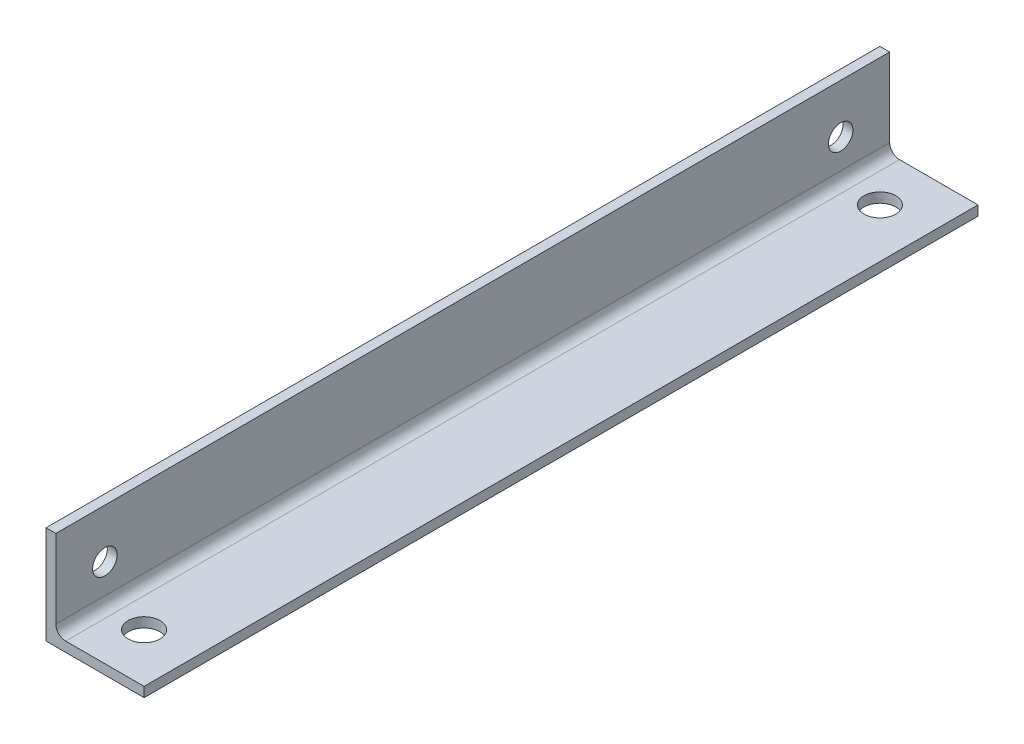
ISO-10303-21;
HEADER;
FILE_DESCRIPTION(('STEP AP214'),'2;1');
FILE_NAME('part.step','',(''),(''),'','','');
FILE_SCHEMA(('AUTOMOTIVE_DESIGN { 1 0 10303 214 1 1 1 1 }'));
ENDSEC;
DATA;
#1=APPLICATION_CONTEXT('core data for automotive mechanical design processes');
#2=APPLICATION_PROTOCOL_DEFINITION('international standard','automotive_design',2000,#1);
#3=PRODUCT_CONTEXT('',#1,'mechanical');
#4=PRODUCT('Part','Part','',(#3));
#5=PRODUCT_RELATED_PRODUCT_CATEGORY('part','',(#4));
#6=PRODUCT_DEFINITION_FORMATION('','',#4);
#7=PRODUCT_DEFINITION_CONTEXT('part definition',#1,'design');
#8=PRODUCT_DEFINITION('design','',#6,#7);
#9=PRODUCT_DEFINITION_SHAPE('','',#8);
#10=(LENGTH_UNIT() NAMED_UNIT(*) SI_UNIT(.MILLI.,.METRE.));
#11=(NAMED_UNIT(*) PLANE_ANGLE_UNIT() SI_UNIT($,.RADIAN.));
#12=(NAMED_UNIT(*) SI_UNIT($,.STERADIAN.) SOLID_ANGLE_UNIT());
#13=UNCERTAINTY_MEASURE_WITH_UNIT(LENGTH_MEASURE(1.E-05),#10,'distance_accuracy_value','');
#14=(GEOMETRIC_REPRESENTATION_CONTEXT(3) GLOBAL_UNCERTAINTY_ASSIGNED_CONTEXT((#13)) GLOBAL_UNIT_ASSIGNED_CONTEXT((#10,
#11,#12)) REPRESENTATION_CONTEXT('',''));
#15=CARTESIAN_POINT('',(0.,0.,0.));
#16=DIRECTION('',(0.,0.,1.));
#17=DIRECTION('',(1.,0.,0.));
#18=AXIS2_PLACEMENT_3D('',#15,#16,#17);
#19=CARTESIAN_POINT('',(10.,0.,10.));
#20=DIRECTION('',(0.,-1.,0.));
#21=DIRECTION('',(0.,0.,-1.));
#22=AXIS2_PLACEMENT_3D('',#19,#20,#21);
#23=CYLINDRICAL_SURFACE('',#22,3.25);
#24=CARTESIAN_POINT('',(10.,2.,10.));
#25=DIRECTION('',(0.,-1.,0.));
#26=DIRECTION('',(0.,0.,-1.));
#27=AXIS2_PLACEMENT_3D('',#24,#25,#26);
#28=CIRCLE('',#27,3.25);
#29=CARTESIAN_POINT('',(10.,2.,6.75000000000001));
#30=VERTEX_POINT('',#29);
#31=EDGE_CURVE('E19',#30,#30,#28,.F.);
#32=ORIENTED_EDGE('',*,*,#31,.T.);
#33=EDGE_LOOP('',(#32));
#34=FACE_BOUND('',#33,.T.);
#35=CARTESIAN_POINT('',(10.,0.,10.));
#36=DIRECTION('',(0.,-1.,0.));
#37=DIRECTION('',(0.,0.,-1.));
#38=AXIS2_PLACEMENT_3D('',#35,#36,#37);
#39=CIRCLE('',#38,3.25);
#40=CARTESIAN_POINT('',(10.,0.,6.75000000000001));
#41=VERTEX_POINT('',#40);
#42=EDGE_CURVE('E114',#41,#41,#39,.T.);
#43=ORIENTED_EDGE('',*,*,#42,.T.);
#44=EDGE_LOOP('',(#43));
#45=FACE_BOUND('',#44,.T.);
#46=ADVANCED_FACE('F16',(#34,#45),#23,.F.);
#47=CARTESIAN_POINT('',(10.,0.,160.));
#48=DIRECTION('',(0.,-1.,0.));
#49=DIRECTION('',(0.,0.,-1.));
#50=AXIS2_PLACEMENT_3D('',#47,#48,#49);
#51=CYLINDRICAL_SURFACE('',#50,3.25);
#52=CARTESIAN_POINT('',(10.,2.,160.));
#53=DIRECTION('',(0.,-1.,0.));
#54=DIRECTION('',(0.,0.,-1.));
#55=AXIS2_PLACEMENT_3D('',#52,#53,#54);
#56=CIRCLE('',#55,3.25);
#57=CARTESIAN_POINT('',(10.,2.,156.75));
#58=VERTEX_POINT('',#57);
#59=EDGE_CURVE('E90',#58,#58,#56,.F.);
#60=ORIENTED_EDGE('',*,*,#59,.T.);
#61=EDGE_LOOP('',(#60));
#62=FACE_BOUND('',#61,.T.);
#63=CARTESIAN_POINT('',(10.,0.,160.));
#64=DIRECTION('',(0.,-1.,0.));
#65=DIRECTION('',(0.,0.,-1.));
#66=AXIS2_PLACEMENT_3D('',#63,#64,#65);
#67=CIRCLE('',#66,3.25);
#68=CARTESIAN_POINT('',(10.,0.,156.75));
#69=VERTEX_POINT('',#68);
#70=EDGE_CURVE('E187',#69,#69,#67,.T.);
#71=ORIENTED_EDGE('',*,*,#70,.T.);
#72=EDGE_LOOP('',(#71));
#73=FACE_BOUND('',#72,.T.);
#74=ADVANCED_FACE('F249',(#62,#73),#51,.F.);
#75=CARTESIAN_POINT('',(2.,20.,170.));
#76=DIRECTION('',(-1.,0.,0.));
#77=DIRECTION('',(0.,-1.,0.));
#78=AXIS2_PLACEMENT_3D('',#75,#76,#77);
#79=PLANE('',#78);
#80=DIRECTION('',(0.,0.,1.));
#81=VECTOR('',#80,1.);
#82=CARTESIAN_POINT('',(2.,4.,170.));
#83=LINE('',#82,#81);
#84=CARTESIAN_POINT('',(2.,4.,170.));
#85=VERTEX_POINT('',#84);
#86=CARTESIAN_POINT('',(2.,4.,0.));
#87=VERTEX_POINT('',#86);
#88=EDGE_CURVE('E74',#85,#87,#83,.F.);
#89=ORIENTED_EDGE('',*,*,#88,.T.);
#90=DIRECTION('',(0.,1.,0.));
#91=VECTOR('',#90,1.);
#92=CARTESIAN_POINT('',(2.,0.,0.));
#93=LINE('',#92,#91);
#94=CARTESIAN_POINT('',(2.,20.,0.));
#95=VERTEX_POINT('',#94);
#96=EDGE_CURVE('E148',#95,#87,#93,.F.);
#97=ORIENTED_EDGE('',*,*,#96,.F.);
#98=DIRECTION('',(0.,0.,-1.));
#99=VECTOR('',#98,1.);
#100=CARTESIAN_POINT('',(2.,20.,170.));
#101=LINE('',#100,#99);
#102=CARTESIAN_POINT('',(2.,20.,170.));
#103=VERTEX_POINT('',#102);
#104=EDGE_CURVE('E120',#95,#103,#101,.F.);
#105=ORIENTED_EDGE('',*,*,#104,.T.);
#106=DIRECTION('',(0.,1.,0.));
#107=VECTOR('',#106,1.);
#108=CARTESIAN_POINT('',(2.,0.,170.));
#109=LINE('',#108,#107);
#110=EDGE_CURVE('E104',#103,#85,#109,.F.);
#111=ORIENTED_EDGE('',*,*,#110,.T.);
#112=EDGE_LOOP('',(#89,#97,#105,#111));
#113=FACE_BOUND('',#112,.T.);
#114=CARTESIAN_POINT('',(2.,10.,10.));
#115=DIRECTION('',(-1.,0.,0.));
#116=DIRECTION('',(0.,0.,1.));
#117=AXIS2_PLACEMENT_3D('',#114,#115,#116);
#118=CIRCLE('',#117,2.5);
#119=CARTESIAN_POINT('',(2.,10.,12.5));
#120=VERTEX_POINT('',#119);
#121=EDGE_CURVE('E116',#120,#120,#118,.T.);
#122=ORIENTED_EDGE('',*,*,#121,.T.);
#123=EDGE_LOOP('',(#122));
#124=FACE_BOUND('',#123,.T.);
#125=CARTESIAN_POINT('',(2.,10.,160.));
#126=DIRECTION('',(-1.,0.,0.));
#127=DIRECTION('',(0.,0.,1.));
#128=AXIS2_PLACEMENT_3D('',#125,#126,#127);
#129=CIRCLE('',#128,2.5);
#130=CARTESIAN_POINT('',(2.,10.,162.5));
#131=VERTEX_POINT('',#130);
#132=EDGE_CURVE('E121',#131,#131,#129,.T.);
#133=ORIENTED_EDGE('',*,*,#132,.T.);
#134=EDGE_LOOP('',(#133));
#135=FACE_BOUND('',#134,.T.);
#136=ADVANCED_FACE('F247',(#113,#124,#135),#79,.F.);
#137=CARTESIAN_POINT('',(4.,4.,170.));
#138=DIRECTION('',(0.,0.,1.));
#139=DIRECTION('',(1.,0.,0.));
#140=AXIS2_PLACEMENT_3D('',#137,#138,#139);
#141=CYLINDRICAL_SURFACE('',#140,2.);
#142=DIRECTION('',(0.,0.,1.));
#143=VECTOR('',#142,1.);
#144=CARTESIAN_POINT('',(4.,2.,170.));
#145=LINE('',#144,#143);
#146=CARTESIAN_POINT('',(4.,2.,170.));
#147=VERTEX_POINT('',#146);
#148=CARTESIAN_POINT('',(4.,2.,0.));
#149=VERTEX_POINT('',#148);
#150=EDGE_CURVE('E81',#147,#149,#145,.F.);
#151=ORIENTED_EDGE('',*,*,#150,.T.);
#152=CARTESIAN_POINT('',(4.,4.,0.));
#153=DIRECTION('',(0.,0.,1.));
#154=DIRECTION('',(1.,0.,0.));
#155=AXIS2_PLACEMENT_3D('',#152,#153,#154);
#156=CIRCLE('',#155,2.);
#157=EDGE_CURVE('E186',#87,#149,#156,.T.);
#158=ORIENTED_EDGE('',*,*,#157,.F.);
#159=ORIENTED_EDGE('',*,*,#88,.F.);
#160=CARTESIAN_POINT('',(4.,4.,170.));
#161=DIRECTION('',(0.,0.,1.));
#162=DIRECTION('',(1.,0.,0.));
#163=AXIS2_PLACEMENT_3D('',#160,#161,#162);
#164=CIRCLE('',#163,2.);
#165=EDGE_CURVE('E96',#85,#147,#164,.T.);
#166=ORIENTED_EDGE('',*,*,#165,.T.);
#167=EDGE_LOOP('',(#151,#158,#159,#166));
#168=FACE_BOUND('',#167,.T.);
#169=ADVANCED_FACE('F102',(#168),#141,.F.);
#170=CARTESIAN_POINT('',(2.,2.,170.));
#171=DIRECTION('',(0.,-1.,0.));
#172=DIRECTION('',(1.,0.,0.));
#173=AXIS2_PLACEMENT_3D('',#170,#171,#172);
#174=PLANE('',#173);
#175=ORIENTED_EDGE('',*,*,#150,.F.);
#176=DIRECTION('',(-1.,0.,0.));
#177=VECTOR('',#176,1.);
#178=CARTESIAN_POINT('',(0.,2.,170.));
#179=LINE('',#178,#177);
#180=CARTESIAN_POINT('',(20.,2.,170.));
#181=VERTEX_POINT('',#180);
#182=EDGE_CURVE('E86',#147,#181,#179,.F.);
#183=ORIENTED_EDGE('',*,*,#182,.T.);
#184=DIRECTION('',(0.,0.,1.));
#185=VECTOR('',#184,1.);
#186=CARTESIAN_POINT('',(20.,2.,170.));
#187=LINE('',#186,#185);
#188=CARTESIAN_POINT('',(20.,2.,0.));
#189=VERTEX_POINT('',#188);
#190=EDGE_CURVE('E89',#181,#189,#187,.F.);
#191=ORIENTED_EDGE('',*,*,#190,.T.);
#192=DIRECTION('',(-1.,0.,0.));
#193=VECTOR('',#192,1.);
#194=CARTESIAN_POINT('',(0.,2.,0.));
#195=LINE('',#194,#193);
#196=EDGE_CURVE('E87',#149,#189,#195,.F.);
#197=ORIENTED_EDGE('',*,*,#196,.F.);
#198=EDGE_LOOP('',(#175,#183,#191,#197));
#199=FACE_BOUND('',#198,.T.);
#200=ORIENTED_EDGE('',*,*,#59,.F.);
#201=EDGE_LOOP('',(#200));
#202=FACE_BOUND('',#201,.T.);
#203=ORIENTED_EDGE('',*,*,#31,.F.);
#204=EDGE_LOOP('',(#203));
#205=FACE_BOUND('',#204,.T.);
#206=ADVANCED_FACE('F83',(#199,#202,#205),#174,.F.);
#207=CARTESIAN_POINT('',(20.,2.,170.));
#208=DIRECTION('',(-1.,0.,0.));
#209=DIRECTION('',(0.,0.,1.));
#210=AXIS2_PLACEMENT_3D('',#207,#208,#209);
#211=PLANE('',#210);
#212=ORIENTED_EDGE('',*,*,#190,.F.);
#213=DIRECTION('',(0.,1.,0.));
#214=VECTOR('',#213,1.);
#215=CARTESIAN_POINT('',(20.,0.,170.));
#216=LINE('',#215,#214);
#217=CARTESIAN_POINT('',(20.,0.,170.));
#218=VERTEX_POINT('',#217);
#219=EDGE_CURVE('E99',#181,#218,#216,.F.);
#220=ORIENTED_EDGE('',*,*,#219,.T.);
#221=DIRECTION('',(0.,0.,1.));
#222=VECTOR('',#221,1.);
#223=CARTESIAN_POINT('',(20.,0.,170.));
#224=LINE('',#223,#222);
#225=CARTESIAN_POINT('',(20.,0.,0.));
#226=VERTEX_POINT('',#225);
#227=EDGE_CURVE('E194',#218,#226,#224,.F.);
#228=ORIENTED_EDGE('',*,*,#227,.T.);
#229=DIRECTION('',(0.,1.,0.));
#230=VECTOR('',#229,1.);
#231=CARTESIAN_POINT('',(20.,0.,0.));
#232=LINE('',#231,#230);
#233=EDGE_CURVE('E185',#189,#226,#232,.F.);
#234=ORIENTED_EDGE('',*,*,#233,.F.);
#235=EDGE_LOOP('',(#212,#220,#228,#234));
#236=FACE_BOUND('',#235,.T.);
#237=ADVANCED_FACE('F230',(#236),#211,.F.);
#238=CARTESIAN_POINT('',(0.,10.,160.));
#239=DIRECTION('',(-1.,0.,0.));
#240=DIRECTION('',(0.,0.,1.));
#241=AXIS2_PLACEMENT_3D('',#238,#239,#240);
#242=CYLINDRICAL_SURFACE('',#241,2.5);
#243=ORIENTED_EDGE('',*,*,#132,.F.);
#244=EDGE_LOOP('',(#243));
#245=FACE_BOUND('',#244,.T.);
#246=CARTESIAN_POINT('',(0.,10.,160.));
#247=DIRECTION('',(-1.,0.,0.));
#248=DIRECTION('',(0.,0.,1.));
#249=AXIS2_PLACEMENT_3D('',#246,#247,#248);
#250=CIRCLE('',#249,2.5);
#251=CARTESIAN_POINT('',(0.,10.,162.5));
#252=VERTEX_POINT('',#251);
#253=EDGE_CURVE('E181',#252,#252,#250,.T.);
#254=ORIENTED_EDGE('',*,*,#253,.T.);
#255=EDGE_LOOP('',(#254));
#256=FACE_BOUND('',#255,.T.);
#257=ADVANCED_FACE('F227',(#245,#256),#242,.F.);
#258=CARTESIAN_POINT('',(0.,10.,10.));
#259=DIRECTION('',(-1.,0.,0.));
#260=DIRECTION('',(0.,0.,1.));
#261=AXIS2_PLACEMENT_3D('',#258,#259,#260);
#262=CYLINDRICAL_SURFACE('',#261,2.5);
#263=ORIENTED_EDGE('',*,*,#121,.F.);
#264=EDGE_LOOP('',(#263));
#265=FACE_BOUND('',#264,.T.);
#266=CARTESIAN_POINT('',(0.,10.,10.));
#267=DIRECTION('',(-1.,0.,0.));
#268=DIRECTION('',(0.,0.,1.));
#269=AXIS2_PLACEMENT_3D('',#266,#267,#268);
#270=CIRCLE('',#269,2.5);
#271=CARTESIAN_POINT('',(0.,10.,12.5));
#272=VERTEX_POINT('',#271);
#273=EDGE_CURVE('E160',#272,#272,#270,.T.);
#274=ORIENTED_EDGE('',*,*,#273,.T.);
#275=EDGE_LOOP('',(#274));
#276=FACE_BOUND('',#275,.T.);
#277=ADVANCED_FACE('F229',(#265,#276),#262,.F.);
#278=CARTESIAN_POINT('',(0.,20.,170.));
#279=DIRECTION('',(0.,-1.,0.));
#280=DIRECTION('',(0.,0.,-1.));
#281=AXIS2_PLACEMENT_3D('',#278,#279,#280);
#282=PLANE('',#281);
#283=DIRECTION('',(0.,0.,-1.));
#284=VECTOR('',#283,1.);
#285=CARTESIAN_POINT('',(0.,20.,170.));
#286=LINE('',#285,#284);
#287=CARTESIAN_POINT('',(0.,20.,0.));
#288=VERTEX_POINT('',#287);
#289=CARTESIAN_POINT('',(0.,20.,170.));
#290=VERTEX_POINT('',#289);
#291=EDGE_CURVE('E155',#288,#290,#286,.F.);
#292=ORIENTED_EDGE('',*,*,#291,.T.);
#293=DIRECTION('',(-1.,0.,0.));
#294=VECTOR('',#293,1.);
#295=CARTESIAN_POINT('',(0.,20.,170.));
#296=LINE('',#295,#294);
#297=EDGE_CURVE('E110',#290,#103,#296,.F.);
#298=ORIENTED_EDGE('',*,*,#297,.T.);
#299=ORIENTED_EDGE('',*,*,#104,.F.);
#300=DIRECTION('',(-1.,0.,0.));
#301=VECTOR('',#300,1.);
#302=CARTESIAN_POINT('',(0.,20.,0.));
#303=LINE('',#302,#301);
#304=EDGE_CURVE('E144',#288,#95,#303,.F.);
#305=ORIENTED_EDGE('',*,*,#304,.F.);
#306=EDGE_LOOP('',(#292,#298,#299,#305));
#307=FACE_BOUND('',#306,.T.);
#308=ADVANCED_FACE('F211',(#307),#282,.F.);
#309=CARTESIAN_POINT('',(0.,0.,170.));
#310=DIRECTION('',(0.,0.,-1.));
#311=DIRECTION('',(-1.,0.,0.));
#312=AXIS2_PLACEMENT_3D('',#309,#310,#311);
#313=PLANE('',#312);
#314=ORIENTED_EDGE('',*,*,#219,.F.);
#315=ORIENTED_EDGE('',*,*,#182,.F.);
#316=ORIENTED_EDGE('',*,*,#165,.F.);
#317=ORIENTED_EDGE('',*,*,#110,.F.);
#318=ORIENTED_EDGE('',*,*,#297,.F.);
#319=DIRECTION('',(0.,1.,0.));
#320=VECTOR('',#319,1.);
#321=CARTESIAN_POINT('',(0.,0.,170.));
#322=LINE('',#321,#320);
#323=CARTESIAN_POINT('',(0.,0.,170.));
#324=VERTEX_POINT('',#323);
#325=EDGE_CURVE('E159',#290,#324,#322,.F.);
#326=ORIENTED_EDGE('',*,*,#325,.T.);
#327=DIRECTION('',(-1.,0.,0.));
#328=VECTOR('',#327,1.);
#329=CARTESIAN_POINT('',(20.,0.,170.));
#330=LINE('',#329,#328);
#331=EDGE_CURVE('E190',#324,#218,#330,.F.);
#332=ORIENTED_EDGE('',*,*,#331,.T.);
#333=EDGE_LOOP('',(#314,#315,#316,#317,#318,#326,#332));
#334=FACE_BOUND('',#333,.T.);
#335=ADVANCED_FACE('F94',(#334),#313,.F.);
#336=CARTESIAN_POINT('',(20.,0.,170.));
#337=DIRECTION('',(0.,1.,0.));
#338=DIRECTION('',(-1.,0.,0.));
#339=AXIS2_PLACEMENT_3D('',#336,#337,#338);
#340=PLANE('',#339);
#341=ORIENTED_EDGE('',*,*,#227,.F.);
#342=ORIENTED_EDGE('',*,*,#331,.F.);
#343=DIRECTION('',(0.,0.,-1.));
#344=VECTOR('',#343,1.);
#345=CARTESIAN_POINT('',(0.,0.,170.));
#346=LINE('',#345,#344);
#347=CARTESIAN_POINT('',(0.,0.,0.));
#348=VERTEX_POINT('',#347);
#349=EDGE_CURVE('E26',#324,#348,#346,.T.);
#350=ORIENTED_EDGE('',*,*,#349,.T.);
#351=DIRECTION('',(-1.,0.,0.));
#352=VECTOR('',#351,1.);
#353=CARTESIAN_POINT('',(0.,0.,0.));
#354=LINE('',#353,#352);
#355=EDGE_CURVE('E34',#226,#348,#354,.T.);
#356=ORIENTED_EDGE('',*,*,#355,.F.);
#357=EDGE_LOOP('',(#341,#342,#350,#356));
#358=FACE_BOUND('',#357,.T.);
#359=ORIENTED_EDGE('',*,*,#70,.F.);
#360=EDGE_LOOP('',(#359));
#361=FACE_BOUND('',#360,.T.);
#362=ORIENTED_EDGE('',*,*,#42,.F.);
#363=EDGE_LOOP('',(#362));
#364=FACE_BOUND('',#363,.T.);
#365=ADVANCED_FACE('F200',(#358,#361,#364),#340,.F.);
#366=CARTESIAN_POINT('',(0.,0.,0.));
#367=DIRECTION('',(0.,0.,-1.));
#368=DIRECTION('',(-1.,0.,0.));
#369=AXIS2_PLACEMENT_3D('',#366,#367,#368);
#370=PLANE('',#369);
#371=ORIENTED_EDGE('',*,*,#196,.T.);
#372=ORIENTED_EDGE('',*,*,#233,.T.);
#373=ORIENTED_EDGE('',*,*,#355,.T.);
#374=DIRECTION('',(0.,1.,0.));
#375=VECTOR('',#374,1.);
#376=CARTESIAN_POINT('',(0.,0.,0.));
#377=LINE('',#376,#375);
#378=EDGE_CURVE('E11',#348,#288,#377,.T.);
#379=ORIENTED_EDGE('',*,*,#378,.T.);
#380=ORIENTED_EDGE('',*,*,#304,.T.);
#381=ORIENTED_EDGE('',*,*,#96,.T.);
#382=ORIENTED_EDGE('',*,*,#157,.T.);
#383=EDGE_LOOP('',(#371,#372,#373,#379,#380,#381,#382));
#384=FACE_BOUND('',#383,.T.);
#385=ADVANCED_FACE('F202',(#384),#370,.T.);
#386=CARTESIAN_POINT('',(0.,0.,170.));
#387=DIRECTION('',(1.,0.,0.));
#388=DIRECTION('',(0.,0.,-1.));
#389=AXIS2_PLACEMENT_3D('',#386,#387,#388);
#390=PLANE('',#389);
#391=ORIENTED_EDGE('',*,*,#349,.F.);
#392=ORIENTED_EDGE('',*,*,#325,.F.);
#393=ORIENTED_EDGE('',*,*,#291,.F.);
#394=ORIENTED_EDGE('',*,*,#378,.F.);
#395=EDGE_LOOP('',(#391,#392,#393,#394));
#396=FACE_BOUND('',#395,.T.);
#397=ORIENTED_EDGE('',*,*,#273,.F.);
#398=EDGE_LOOP('',(#397));
#399=FACE_BOUND('',#398,.T.);
#400=ORIENTED_EDGE('',*,*,#253,.F.);
#401=EDGE_LOOP('',(#400));
#402=FACE_BOUND('',#401,.T.);
#403=ADVANCED_FACE('F209',(#396,#399,#402),#390,.F.);
#404=CLOSED_SHELL('',(#46,#74,#136,#169,#206,#237,#257,#277,#308,#335,#365,#385,#403));
#405=MANIFOLD_SOLID_BREP('B1',#404);
#406=ADVANCED_BREP_SHAPE_REPRESENTATION('',(#18,#405),#14);
#407=SHAPE_DEFINITION_REPRESENTATION(#9,#406);
ENDSEC;
END-ISO-10303-21;
